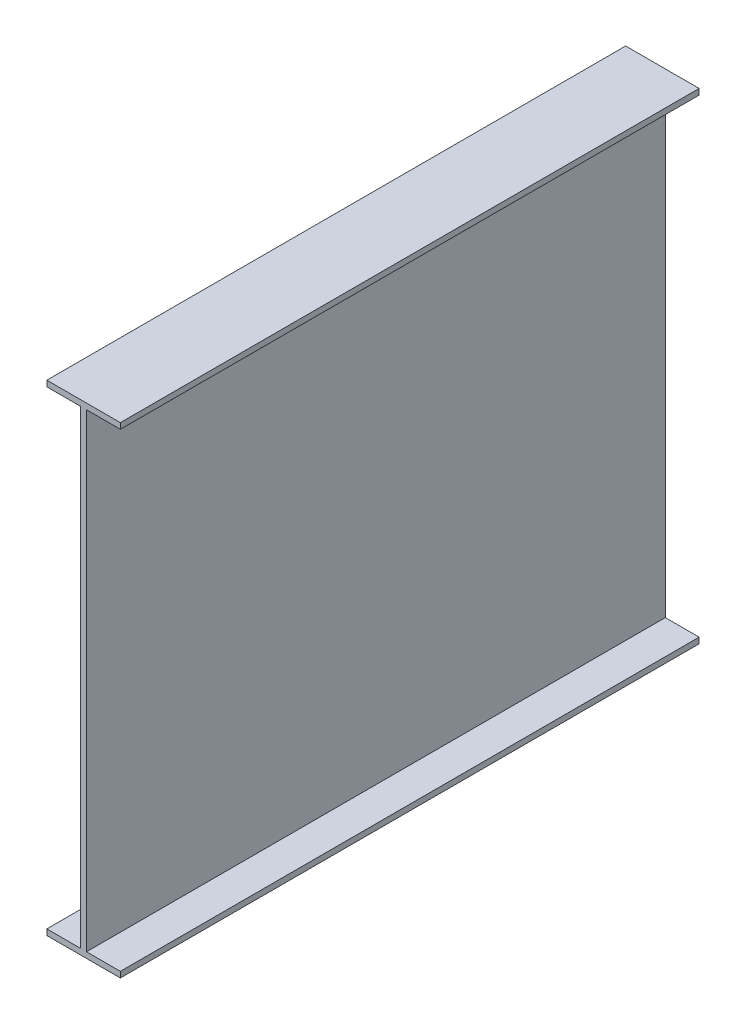
ISO-10303-21;
HEADER;
FILE_DESCRIPTION(('STEP AP214'),'2;1');
FILE_NAME('part.step','',(''),(''),'','','');
FILE_SCHEMA(('AUTOMOTIVE_DESIGN { 1 0 10303 214 1 1 1 1 }'));
ENDSEC;
DATA;
#1=APPLICATION_CONTEXT('core data for automotive mechanical design processes');
#2=APPLICATION_PROTOCOL_DEFINITION('international standard','automotive_design',2000,#1);
#3=PRODUCT_CONTEXT('',#1,'mechanical');
#4=PRODUCT('Part','Part','',(#3));
#5=PRODUCT_RELATED_PRODUCT_CATEGORY('part','',(#4));
#6=PRODUCT_DEFINITION_FORMATION('','',#4);
#7=PRODUCT_DEFINITION_CONTEXT('part definition',#1,'design');
#8=PRODUCT_DEFINITION('design','',#6,#7);
#9=PRODUCT_DEFINITION_SHAPE('','',#8);
#10=(LENGTH_UNIT() NAMED_UNIT(*) SI_UNIT(.MILLI.,.METRE.));
#11=(NAMED_UNIT(*) PLANE_ANGLE_UNIT() SI_UNIT($,.RADIAN.));
#12=(NAMED_UNIT(*) SI_UNIT($,.STERADIAN.) SOLID_ANGLE_UNIT());
#13=UNCERTAINTY_MEASURE_WITH_UNIT(LENGTH_MEASURE(1.E-05),#10,'distance_accuracy_value','');
#14=(GEOMETRIC_REPRESENTATION_CONTEXT(3) GLOBAL_UNCERTAINTY_ASSIGNED_CONTEXT((#13)) GLOBAL_UNIT_ASSIGNED_CONTEXT((#10,
#11,#12)) REPRESENTATION_CONTEXT('',''));
#15=CARTESIAN_POINT('',(0.,0.,0.));
#16=DIRECTION('',(0.,0.,1.));
#17=DIRECTION('',(1.,0.,0.));
#18=AXIS2_PLACEMENT_3D('',#15,#16,#17);
#19=CARTESIAN_POINT('',(-58.5,0.,-1000.));
#20=DIRECTION('',(0.,1.,0.));
#21=DIRECTION('',(0.,0.,1.));
#22=AXIS2_PLACEMENT_3D('',#19,#20,#21);
#23=PLANE('',#22);
#24=DIRECTION('',(-1.,0.,0.));
#25=VECTOR('',#24,1.);
#26=CARTESIAN_POINT('',(-58.5,0.,0.));
#27=LINE('',#26,#25);
#28=CARTESIAN_POINT('',(0.,0.,0.));
#29=VERTEX_POINT('',#28);
#30=CARTESIAN_POINT('',(-58.5,0.,0.));
#31=VERTEX_POINT('',#30);
#32=EDGE_CURVE('E168',#29,#31,#27,.T.);
#33=ORIENTED_EDGE('',*,*,#32,.F.);
#34=DIRECTION('',(0.,0.,1.));
#35=VECTOR('',#34,1.);
#36=CARTESIAN_POINT('',(0.,0.,-1000.));
#37=LINE('',#36,#35);
#38=CARTESIAN_POINT('',(0.,0.,-1000.));
#39=VERTEX_POINT('',#38);
#40=EDGE_CURVE('E11',#39,#29,#37,.T.);
#41=ORIENTED_EDGE('',*,*,#40,.F.);
#42=DIRECTION('',(-1.,0.,0.));
#43=VECTOR('',#42,1.);
#44=CARTESIAN_POINT('',(-58.5,0.,-1000.));
#45=LINE('',#44,#43);
#46=CARTESIAN_POINT('',(-58.5,0.,-1000.));
#47=VERTEX_POINT('',#46);
#48=EDGE_CURVE('E212',#39,#47,#45,.T.);
#49=ORIENTED_EDGE('',*,*,#48,.T.);
#50=DIRECTION('',(0.,0.,1.));
#51=VECTOR('',#50,1.);
#52=CARTESIAN_POINT('',(-58.5,0.,-1000.));
#53=LINE('',#52,#51);
#54=EDGE_CURVE('E44',#47,#31,#53,.T.);
#55=ORIENTED_EDGE('',*,*,#54,.T.);
#56=EDGE_LOOP('',(#33,#41,#49,#55));
#57=FACE_BOUND('',#56,.T.);
#58=ADVANCED_FACE('F41',(#57),#23,.T.);
#59=CARTESIAN_POINT('',(0.,0.,-1000.));
#60=DIRECTION('',(-1.,0.,0.));
#61=DIRECTION('',(0.,0.,1.));
#62=AXIS2_PLACEMENT_3D('',#59,#60,#61);
#63=PLANE('',#62);
#64=DIRECTION('',(0.,-1.,0.));
#65=VECTOR('',#64,1.);
#66=CARTESIAN_POINT('',(0.,0.,0.));
#67=LINE('',#66,#65);
#68=CARTESIAN_POINT('',(0.,811.,0.));
#69=VERTEX_POINT('',#68);
#70=EDGE_CURVE('E209',#69,#29,#67,.T.);
#71=ORIENTED_EDGE('',*,*,#70,.F.);
#72=DIRECTION('',(0.,0.,1.));
#73=VECTOR('',#72,1.);
#74=CARTESIAN_POINT('',(0.,811.,-1000.));
#75=LINE('',#74,#73);
#76=CARTESIAN_POINT('',(0.,811.,-1000.));
#77=VERTEX_POINT('',#76);
#78=EDGE_CURVE('E51',#77,#69,#75,.T.);
#79=ORIENTED_EDGE('',*,*,#78,.F.);
#80=DIRECTION('',(0.,-1.,0.));
#81=VECTOR('',#80,1.);
#82=CARTESIAN_POINT('',(0.,0.,-1000.));
#83=LINE('',#82,#81);
#84=EDGE_CURVE('E154',#77,#39,#83,.T.);
#85=ORIENTED_EDGE('',*,*,#84,.T.);
#86=ORIENTED_EDGE('',*,*,#40,.T.);
#87=EDGE_LOOP('',(#71,#79,#85,#86));
#88=FACE_BOUND('',#87,.T.);
#89=ADVANCED_FACE('F242',(#88),#63,.T.);
#90=CARTESIAN_POINT('',(-58.5,811.,-1000.));
#91=DIRECTION('',(0.,-1.,0.));
#92=DIRECTION('',(0.,0.,-1.));
#93=AXIS2_PLACEMENT_3D('',#90,#91,#92);
#94=PLANE('',#93);
#95=DIRECTION('',(1.,0.,0.));
#96=VECTOR('',#95,1.);
#97=CARTESIAN_POINT('',(-58.5,811.,0.));
#98=LINE('',#97,#96);
#99=CARTESIAN_POINT('',(-58.5,811.,0.));
#100=VERTEX_POINT('',#99);
#101=EDGE_CURVE('E140',#100,#69,#98,.T.);
#102=ORIENTED_EDGE('',*,*,#101,.F.);
#103=DIRECTION('',(0.,0.,1.));
#104=VECTOR('',#103,1.);
#105=CARTESIAN_POINT('',(-58.5,811.,-1000.));
#106=LINE('',#105,#104);
#107=CARTESIAN_POINT('',(-58.5,811.,-1000.));
#108=VERTEX_POINT('',#107);
#109=EDGE_CURVE('E135',#108,#100,#106,.T.);
#110=ORIENTED_EDGE('',*,*,#109,.F.);
#111=DIRECTION('',(1.,0.,0.));
#112=VECTOR('',#111,1.);
#113=CARTESIAN_POINT('',(-58.5,811.,-1000.));
#114=LINE('',#113,#112);
#115=EDGE_CURVE('E138',#108,#77,#114,.T.);
#116=ORIENTED_EDGE('',*,*,#115,.T.);
#117=ORIENTED_EDGE('',*,*,#78,.T.);
#118=EDGE_LOOP('',(#102,#110,#116,#117));
#119=FACE_BOUND('',#118,.T.);
#120=ADVANCED_FACE('F137',(#119),#94,.T.);
#121=CARTESIAN_POINT('',(-58.5,811.,-1000.));
#122=DIRECTION('',(-1.,0.,0.));
#123=DIRECTION('',(0.,0.,1.));
#124=AXIS2_PLACEMENT_3D('',#121,#122,#123);
#125=PLANE('',#124);
#126=DIRECTION('',(0.,-1.,0.));
#127=VECTOR('',#126,1.);
#128=CARTESIAN_POINT('',(-58.5,811.,0.));
#129=LINE('',#128,#127);
#130=CARTESIAN_POINT('',(-58.5,821.,0.));
#131=VERTEX_POINT('',#130);
#132=EDGE_CURVE('E204',#131,#100,#129,.T.);
#133=ORIENTED_EDGE('',*,*,#132,.F.);
#134=DIRECTION('',(0.,0.,1.));
#135=VECTOR('',#134,1.);
#136=CARTESIAN_POINT('',(-58.5,821.,-1000.));
#137=LINE('',#136,#135);
#138=CARTESIAN_POINT('',(-58.5,821.,-1000.));
#139=VERTEX_POINT('',#138);
#140=EDGE_CURVE('E146',#139,#131,#137,.T.);
#141=ORIENTED_EDGE('',*,*,#140,.F.);
#142=DIRECTION('',(0.,-1.,0.));
#143=VECTOR('',#142,1.);
#144=CARTESIAN_POINT('',(-58.5,811.,-1000.));
#145=LINE('',#144,#143);
#146=EDGE_CURVE('E152',#139,#108,#145,.T.);
#147=ORIENTED_EDGE('',*,*,#146,.T.);
#148=ORIENTED_EDGE('',*,*,#109,.T.);
#149=EDGE_LOOP('',(#133,#141,#147,#148));
#150=FACE_BOUND('',#149,.T.);
#151=ADVANCED_FACE('F157',(#150),#125,.T.);
#152=CARTESIAN_POINT('',(-58.5,821.,-1000.));
#153=DIRECTION('',(0.,1.,0.));
#154=DIRECTION('',(0.,0.,1.));
#155=AXIS2_PLACEMENT_3D('',#152,#153,#154);
#156=PLANE('',#155);
#157=DIRECTION('',(-1.,0.,0.));
#158=VECTOR('',#157,1.);
#159=CARTESIAN_POINT('',(-58.5,821.,0.));
#160=LINE('',#159,#158);
#161=CARTESIAN_POINT('',(68.5,821.,0.));
#162=VERTEX_POINT('',#161);
#163=EDGE_CURVE('E200',#162,#131,#160,.T.);
#164=ORIENTED_EDGE('',*,*,#163,.F.);
#165=DIRECTION('',(0.,0.,1.));
#166=VECTOR('',#165,1.);
#167=CARTESIAN_POINT('',(68.5,821.,-1000.));
#168=LINE('',#167,#166);
#169=CARTESIAN_POINT('',(68.5,821.,-1000.));
#170=VERTEX_POINT('',#169);
#171=EDGE_CURVE('E218',#170,#162,#168,.T.);
#172=ORIENTED_EDGE('',*,*,#171,.F.);
#173=DIRECTION('',(-1.,0.,0.));
#174=VECTOR('',#173,1.);
#175=CARTESIAN_POINT('',(-58.5,821.,-1000.));
#176=LINE('',#175,#174);
#177=EDGE_CURVE('E159',#170,#139,#176,.T.);
#178=ORIENTED_EDGE('',*,*,#177,.T.);
#179=ORIENTED_EDGE('',*,*,#140,.T.);
#180=EDGE_LOOP('',(#164,#172,#178,#179));
#181=FACE_BOUND('',#180,.T.);
#182=ADVANCED_FACE('F255',(#181),#156,.T.);
#183=CARTESIAN_POINT('',(68.5,811.,-1000.));
#184=DIRECTION('',(1.,0.,0.));
#185=DIRECTION('',(0.,0.,-1.));
#186=AXIS2_PLACEMENT_3D('',#183,#184,#185);
#187=PLANE('',#186);
#188=DIRECTION('',(0.,1.,0.));
#189=VECTOR('',#188,1.);
#190=CARTESIAN_POINT('',(68.5,811.,0.));
#191=LINE('',#190,#189);
#192=CARTESIAN_POINT('',(68.5,811.,0.));
#193=VERTEX_POINT('',#192);
#194=EDGE_CURVE('E196',#193,#162,#191,.T.);
#195=ORIENTED_EDGE('',*,*,#194,.F.);
#196=DIRECTION('',(0.,0.,1.));
#197=VECTOR('',#196,1.);
#198=CARTESIAN_POINT('',(68.5,811.,-1000.));
#199=LINE('',#198,#197);
#200=CARTESIAN_POINT('',(68.5,811.,-1000.));
#201=VERTEX_POINT('',#200);
#202=EDGE_CURVE('E221',#201,#193,#199,.T.);
#203=ORIENTED_EDGE('',*,*,#202,.F.);
#204=DIRECTION('',(0.,1.,0.));
#205=VECTOR('',#204,1.);
#206=CARTESIAN_POINT('',(68.5,811.,-1000.));
#207=LINE('',#206,#205);
#208=EDGE_CURVE('E162',#201,#170,#207,.T.);
#209=ORIENTED_EDGE('',*,*,#208,.T.);
#210=ORIENTED_EDGE('',*,*,#171,.T.);
#211=EDGE_LOOP('',(#195,#203,#209,#210));
#212=FACE_BOUND('',#211,.T.);
#213=ADVANCED_FACE('F258',(#212),#187,.T.);
#214=CARTESIAN_POINT('',(10.,811.,-1000.));
#215=DIRECTION('',(0.,-1.,0.));
#216=DIRECTION('',(0.,0.,-1.));
#217=AXIS2_PLACEMENT_3D('',#214,#215,#216);
#218=PLANE('',#217);
#219=DIRECTION('',(1.,0.,0.));
#220=VECTOR('',#219,1.);
#221=CARTESIAN_POINT('',(10.,811.,0.));
#222=LINE('',#221,#220);
#223=CARTESIAN_POINT('',(10.,811.,0.));
#224=VERTEX_POINT('',#223);
#225=EDGE_CURVE('E192',#224,#193,#222,.T.);
#226=ORIENTED_EDGE('',*,*,#225,.F.);
#227=DIRECTION('',(0.,0.,1.));
#228=VECTOR('',#227,1.);
#229=CARTESIAN_POINT('',(10.,811.,-1000.));
#230=LINE('',#229,#228);
#231=CARTESIAN_POINT('',(10.,811.,-1000.));
#232=VERTEX_POINT('',#231);
#233=EDGE_CURVE('E224',#232,#224,#230,.T.);
#234=ORIENTED_EDGE('',*,*,#233,.F.);
#235=DIRECTION('',(1.,0.,0.));
#236=VECTOR('',#235,1.);
#237=CARTESIAN_POINT('',(10.,811.,-1000.));
#238=LINE('',#237,#236);
#239=EDGE_CURVE('E384',#232,#201,#238,.T.);
#240=ORIENTED_EDGE('',*,*,#239,.T.);
#241=ORIENTED_EDGE('',*,*,#202,.T.);
#242=EDGE_LOOP('',(#226,#234,#240,#241));
#243=FACE_BOUND('',#242,.T.);
#244=ADVANCED_FACE('F262',(#243),#218,.T.);
#245=CARTESIAN_POINT('',(10.,0.,-1000.));
#246=DIRECTION('',(1.,0.,0.));
#247=DIRECTION('',(0.,0.,-1.));
#248=AXIS2_PLACEMENT_3D('',#245,#246,#247);
#249=PLANE('',#248);
#250=DIRECTION('',(0.,1.,0.));
#251=VECTOR('',#250,1.);
#252=CARTESIAN_POINT('',(10.,0.,0.));
#253=LINE('',#252,#251);
#254=CARTESIAN_POINT('',(10.,0.,0.));
#255=VERTEX_POINT('',#254);
#256=EDGE_CURVE('E188',#255,#224,#253,.T.);
#257=ORIENTED_EDGE('',*,*,#256,.F.);
#258=DIRECTION('',(0.,0.,1.));
#259=VECTOR('',#258,1.);
#260=CARTESIAN_POINT('',(10.,0.,-1000.));
#261=LINE('',#260,#259);
#262=CARTESIAN_POINT('',(10.,0.,-1000.));
#263=VERTEX_POINT('',#262);
#264=EDGE_CURVE('E227',#263,#255,#261,.T.);
#265=ORIENTED_EDGE('',*,*,#264,.F.);
#266=DIRECTION('',(0.,1.,0.));
#267=VECTOR('',#266,1.);
#268=CARTESIAN_POINT('',(10.,0.,-1000.));
#269=LINE('',#268,#267);
#270=EDGE_CURVE('E390',#263,#232,#269,.T.);
#271=ORIENTED_EDGE('',*,*,#270,.T.);
#272=ORIENTED_EDGE('',*,*,#233,.T.);
#273=EDGE_LOOP('',(#257,#265,#271,#272));
#274=FACE_BOUND('',#273,.T.);
#275=ADVANCED_FACE('F266',(#274),#249,.T.);
#276=CARTESIAN_POINT('',(10.,0.,-1000.));
#277=DIRECTION('',(0.,1.,0.));
#278=DIRECTION('',(0.,0.,1.));
#279=AXIS2_PLACEMENT_3D('',#276,#277,#278);
#280=PLANE('',#279);
#281=DIRECTION('',(-1.,0.,0.));
#282=VECTOR('',#281,1.);
#283=CARTESIAN_POINT('',(10.,0.,0.));
#284=LINE('',#283,#282);
#285=CARTESIAN_POINT('',(68.5,0.,0.));
#286=VERTEX_POINT('',#285);
#287=EDGE_CURVE('E184',#286,#255,#284,.T.);
#288=ORIENTED_EDGE('',*,*,#287,.F.);
#289=DIRECTION('',(0.,0.,1.));
#290=VECTOR('',#289,1.);
#291=CARTESIAN_POINT('',(68.5,0.,-1000.));
#292=LINE('',#291,#290);
#293=CARTESIAN_POINT('',(68.5,0.,-1000.));
#294=VERTEX_POINT('',#293);
#295=EDGE_CURVE('E230',#294,#286,#292,.T.);
#296=ORIENTED_EDGE('',*,*,#295,.F.);
#297=DIRECTION('',(-1.,0.,0.));
#298=VECTOR('',#297,1.);
#299=CARTESIAN_POINT('',(10.,0.,-1000.));
#300=LINE('',#299,#298);
#301=EDGE_CURVE('E377',#294,#263,#300,.T.);
#302=ORIENTED_EDGE('',*,*,#301,.T.);
#303=ORIENTED_EDGE('',*,*,#264,.T.);
#304=EDGE_LOOP('',(#288,#296,#302,#303));
#305=FACE_BOUND('',#304,.T.);
#306=ADVANCED_FACE('F270',(#305),#280,.T.);
#307=CARTESIAN_POINT('',(68.5,-10.,-1000.));
#308=DIRECTION('',(1.,0.,0.));
#309=DIRECTION('',(0.,0.,-1.));
#310=AXIS2_PLACEMENT_3D('',#307,#308,#309);
#311=PLANE('',#310);
#312=DIRECTION('',(0.,1.,0.));
#313=VECTOR('',#312,1.);
#314=CARTESIAN_POINT('',(68.5,-10.,0.));
#315=LINE('',#314,#313);
#316=CARTESIAN_POINT('',(68.5,-10.,0.));
#317=VERTEX_POINT('',#316);
#318=EDGE_CURVE('E180',#317,#286,#315,.T.);
#319=ORIENTED_EDGE('',*,*,#318,.F.);
#320=DIRECTION('',(0.,0.,1.));
#321=VECTOR('',#320,1.);
#322=CARTESIAN_POINT('',(68.5,-10.,-1000.));
#323=LINE('',#322,#321);
#324=CARTESIAN_POINT('',(68.5,-10.,-1000.));
#325=VERTEX_POINT('',#324);
#326=EDGE_CURVE('E233',#325,#317,#323,.T.);
#327=ORIENTED_EDGE('',*,*,#326,.F.);
#328=DIRECTION('',(0.,1.,0.));
#329=VECTOR('',#328,1.);
#330=CARTESIAN_POINT('',(68.5,-10.,-1000.));
#331=LINE('',#330,#329);
#332=EDGE_CURVE('E373',#325,#294,#331,.T.);
#333=ORIENTED_EDGE('',*,*,#332,.T.);
#334=ORIENTED_EDGE('',*,*,#295,.T.);
#335=EDGE_LOOP('',(#319,#327,#333,#334));
#336=FACE_BOUND('',#335,.T.);
#337=ADVANCED_FACE('F274',(#336),#311,.T.);
#338=CARTESIAN_POINT('',(-58.5,-10.,-1000.));
#339=DIRECTION('',(0.,-1.,0.));
#340=DIRECTION('',(0.,0.,-1.));
#341=AXIS2_PLACEMENT_3D('',#338,#339,#340);
#342=PLANE('',#341);
#343=DIRECTION('',(1.,0.,0.));
#344=VECTOR('',#343,1.);
#345=CARTESIAN_POINT('',(-58.5,-10.,0.));
#346=LINE('',#345,#344);
#347=CARTESIAN_POINT('',(-58.5,-10.,0.));
#348=VERTEX_POINT('',#347);
#349=EDGE_CURVE('E176',#348,#317,#346,.T.);
#350=ORIENTED_EDGE('',*,*,#349,.F.);
#351=DIRECTION('',(0.,0.,1.));
#352=VECTOR('',#351,1.);
#353=CARTESIAN_POINT('',(-58.5,-10.,-1000.));
#354=LINE('',#353,#352);
#355=CARTESIAN_POINT('',(-58.5,-10.,-1000.));
#356=VERTEX_POINT('',#355);
#357=EDGE_CURVE('E235',#356,#348,#354,.T.);
#358=ORIENTED_EDGE('',*,*,#357,.F.);
#359=DIRECTION('',(1.,0.,0.));
#360=VECTOR('',#359,1.);
#361=CARTESIAN_POINT('',(-58.5,-10.,-1000.));
#362=LINE('',#361,#360);
#363=EDGE_CURVE('E399',#356,#325,#362,.T.);
#364=ORIENTED_EDGE('',*,*,#363,.T.);
#365=ORIENTED_EDGE('',*,*,#326,.T.);
#366=EDGE_LOOP('',(#350,#358,#364,#365));
#367=FACE_BOUND('',#366,.T.);
#368=ADVANCED_FACE('F278',(#367),#342,.T.);
#369=CARTESIAN_POINT('',(-58.5,-10.,-1000.));
#370=DIRECTION('',(-1.,0.,0.));
#371=DIRECTION('',(0.,0.,1.));
#372=AXIS2_PLACEMENT_3D('',#369,#370,#371);
#373=PLANE('',#372);
#374=DIRECTION('',(0.,-1.,0.));
#375=VECTOR('',#374,1.);
#376=CARTESIAN_POINT('',(-58.5,-10.,0.));
#377=LINE('',#376,#375);
#378=EDGE_CURVE('E172',#31,#348,#377,.T.);
#379=ORIENTED_EDGE('',*,*,#378,.F.);
#380=ORIENTED_EDGE('',*,*,#54,.F.);
#381=DIRECTION('',(0.,-1.,0.));
#382=VECTOR('',#381,1.);
#383=CARTESIAN_POINT('',(-58.5,-10.,-1000.));
#384=LINE('',#383,#382);
#385=EDGE_CURVE('E402',#47,#356,#384,.T.);
#386=ORIENTED_EDGE('',*,*,#385,.T.);
#387=ORIENTED_EDGE('',*,*,#357,.T.);
#388=EDGE_LOOP('',(#379,#380,#386,#387));
#389=FACE_BOUND('',#388,.T.);
#390=ADVANCED_FACE('F239',(#389),#373,.T.);
#391=CARTESIAN_POINT('',(0.,0.,-1000.));
#392=DIRECTION('',(0.,0.,1.));
#393=DIRECTION('',(1.,0.,0.));
#394=AXIS2_PLACEMENT_3D('',#391,#392,#393);
#395=PLANE('',#394);
#396=ORIENTED_EDGE('',*,*,#48,.F.);
#397=ORIENTED_EDGE('',*,*,#84,.F.);
#398=ORIENTED_EDGE('',*,*,#115,.F.);
#399=ORIENTED_EDGE('',*,*,#146,.F.);
#400=ORIENTED_EDGE('',*,*,#177,.F.);
#401=ORIENTED_EDGE('',*,*,#208,.F.);
#402=ORIENTED_EDGE('',*,*,#239,.F.);
#403=ORIENTED_EDGE('',*,*,#270,.F.);
#404=ORIENTED_EDGE('',*,*,#301,.F.);
#405=ORIENTED_EDGE('',*,*,#332,.F.);
#406=ORIENTED_EDGE('',*,*,#363,.F.);
#407=ORIENTED_EDGE('',*,*,#385,.F.);
#408=EDGE_LOOP('',(#396,#397,#398,#399,#400,#401,#402,#403,#404,#405,#406,#407));
#409=FACE_BOUND('',#408,.T.);
#410=ADVANCED_FACE('F150',(#409),#395,.F.);
#411=CARTESIAN_POINT('',(0.,0.,0.));
#412=DIRECTION('',(0.,0.,1.));
#413=DIRECTION('',(1.,0.,0.));
#414=AXIS2_PLACEMENT_3D('',#411,#412,#413);
#415=PLANE('',#414);
#416=ORIENTED_EDGE('',*,*,#32,.T.);
#417=ORIENTED_EDGE('',*,*,#378,.T.);
#418=ORIENTED_EDGE('',*,*,#349,.T.);
#419=ORIENTED_EDGE('',*,*,#318,.T.);
#420=ORIENTED_EDGE('',*,*,#287,.T.);
#421=ORIENTED_EDGE('',*,*,#256,.T.);
#422=ORIENTED_EDGE('',*,*,#225,.T.);
#423=ORIENTED_EDGE('',*,*,#194,.T.);
#424=ORIENTED_EDGE('',*,*,#163,.T.);
#425=ORIENTED_EDGE('',*,*,#132,.T.);
#426=ORIENTED_EDGE('',*,*,#101,.T.);
#427=ORIENTED_EDGE('',*,*,#70,.T.);
#428=EDGE_LOOP('',(#416,#417,#418,#419,#420,#421,#422,#423,#424,#425,#426,#427));
#429=FACE_BOUND('',#428,.T.);
#430=ADVANCED_FACE('F241',(#429),#415,.T.);
#431=CLOSED_SHELL('',(#58,#89,#120,#151,#182,#213,#244,#275,#306,#337,#368,#390,#410,#430));
#432=MANIFOLD_SOLID_BREP('B2',#431);
#433=ADVANCED_BREP_SHAPE_REPRESENTATION('',(#18,#432),#14);
#434=SHAPE_DEFINITION_REPRESENTATION(#9,#433);
ENDSEC;
END-ISO-10303-21;
